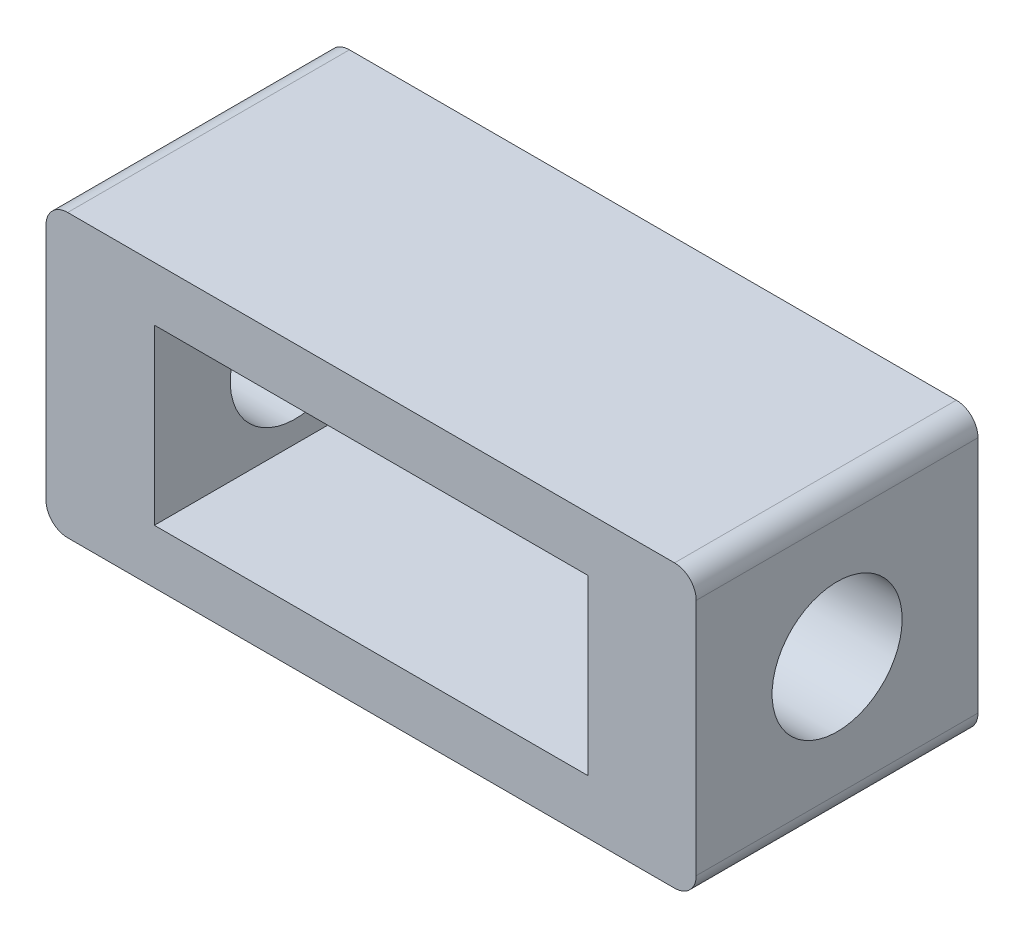
ISO-10303-21;
HEADER;
FILE_DESCRIPTION(('STEP AP214'),'2;1');
FILE_NAME('part.step','',(''),(''),'','','');
FILE_SCHEMA(('AUTOMOTIVE_DESIGN { 1 0 10303 214 1 1 1 1 }'));
ENDSEC;
DATA;
#1=APPLICATION_CONTEXT('core data for automotive mechanical design processes');
#2=APPLICATION_PROTOCOL_DEFINITION('international standard','automotive_design',2000,#1);
#3=PRODUCT_CONTEXT('',#1,'mechanical');
#4=PRODUCT('Part','Part','',(#3));
#5=PRODUCT_RELATED_PRODUCT_CATEGORY('part','',(#4));
#6=PRODUCT_DEFINITION_FORMATION('','',#4);
#7=PRODUCT_DEFINITION_CONTEXT('part definition',#1,'design');
#8=PRODUCT_DEFINITION('design','',#6,#7);
#9=PRODUCT_DEFINITION_SHAPE('','',#8);
#10=(LENGTH_UNIT() NAMED_UNIT(*) SI_UNIT(.MILLI.,.METRE.));
#11=(NAMED_UNIT(*) PLANE_ANGLE_UNIT() SI_UNIT($,.RADIAN.));
#12=(NAMED_UNIT(*) SI_UNIT($,.STERADIAN.) SOLID_ANGLE_UNIT());
#13=UNCERTAINTY_MEASURE_WITH_UNIT(LENGTH_MEASURE(1.E-05),#10,'distance_accuracy_value','');
#14=(GEOMETRIC_REPRESENTATION_CONTEXT(3) GLOBAL_UNCERTAINTY_ASSIGNED_CONTEXT((#13)) GLOBAL_UNIT_ASSIGNED_CONTEXT((#10,
#11,#12)) REPRESENTATION_CONTEXT('',''));
#15=CARTESIAN_POINT('',(0.,0.,0.));
#16=DIRECTION('',(0.,0.,1.));
#17=DIRECTION('',(1.,0.,0.));
#18=AXIS2_PLACEMENT_3D('',#15,#16,#17);
#19=CARTESIAN_POINT('',(2.,24.,26.));
#20=DIRECTION('',(0.,0.,-1.));
#21=DIRECTION('',(-1.,0.,0.));
#22=AXIS2_PLACEMENT_3D('',#19,#20,#21);
#23=PLANE('',#22);
#24=CARTESIAN_POINT('',(2.,24.,26.));
#25=DIRECTION('',(0.,0.,1.));
#26=DIRECTION('',(-1.,0.,0.));
#27=AXIS2_PLACEMENT_3D('',#24,#25,#26);
#28=CIRCLE('',#27,2.);
#29=CARTESIAN_POINT('',(2.00000000000001,26.,26.));
#30=VERTEX_POINT('',#29);
#31=CARTESIAN_POINT('',(0.,24.,26.));
#32=VERTEX_POINT('',#31);
#33=EDGE_CURVE('E160',#30,#32,#28,.T.);
#34=ORIENTED_EDGE('',*,*,#33,.T.);
#35=DIRECTION('',(0.,-1.,0.));
#36=VECTOR('',#35,1.);
#37=CARTESIAN_POINT('',(0.,2.00000000000001,26.));
#38=LINE('',#37,#36);
#39=CARTESIAN_POINT('',(0.,2.00000000000001,26.));
#40=VERTEX_POINT('',#39);
#41=EDGE_CURVE('E163',#32,#40,#38,.T.);
#42=ORIENTED_EDGE('',*,*,#41,.T.);
#43=CARTESIAN_POINT('',(2.,2.,26.));
#44=DIRECTION('',(0.,0.,1.));
#45=DIRECTION('',(-1.,0.,0.));
#46=AXIS2_PLACEMENT_3D('',#43,#44,#45);
#47=CIRCLE('',#46,2.);
#48=CARTESIAN_POINT('',(2.00000000000001,0.,26.));
#49=VERTEX_POINT('',#48);
#50=EDGE_CURVE('E166',#40,#49,#47,.T.);
#51=ORIENTED_EDGE('',*,*,#50,.T.);
#52=DIRECTION('',(1.,0.,0.));
#53=VECTOR('',#52,1.);
#54=CARTESIAN_POINT('',(2.00000000000001,0.,26.));
#55=LINE('',#54,#53);
#56=CARTESIAN_POINT('',(58.,0.,26.));
#57=VERTEX_POINT('',#56);
#58=EDGE_CURVE('E168',#49,#57,#55,.T.);
#59=ORIENTED_EDGE('',*,*,#58,.T.);
#60=CARTESIAN_POINT('',(58.,2.,26.));
#61=DIRECTION('',(0.,0.,1.));
#62=DIRECTION('',(1.,0.,0.));
#63=AXIS2_PLACEMENT_3D('',#60,#61,#62);
#64=CIRCLE('',#63,2.);
#65=CARTESIAN_POINT('',(60.,2.,26.));
#66=VERTEX_POINT('',#65);
#67=EDGE_CURVE('E170',#57,#66,#64,.T.);
#68=ORIENTED_EDGE('',*,*,#67,.T.);
#69=DIRECTION('',(0.,1.,0.));
#70=VECTOR('',#69,1.);
#71=CARTESIAN_POINT('',(60.,2.,26.));
#72=LINE('',#71,#70);
#73=CARTESIAN_POINT('',(60.,24.,26.));
#74=VERTEX_POINT('',#73);
#75=EDGE_CURVE('E172',#66,#74,#72,.T.);
#76=ORIENTED_EDGE('',*,*,#75,.T.);
#77=CARTESIAN_POINT('',(58.,24.,26.));
#78=DIRECTION('',(0.,0.,1.));
#79=DIRECTION('',(-1.,0.,0.));
#80=AXIS2_PLACEMENT_3D('',#77,#78,#79);
#81=CIRCLE('',#80,2.);
#82=CARTESIAN_POINT('',(58.,26.,26.));
#83=VERTEX_POINT('',#82);
#84=EDGE_CURVE('E174',#74,#83,#81,.T.);
#85=ORIENTED_EDGE('',*,*,#84,.T.);
#86=DIRECTION('',(-1.,0.,0.));
#87=VECTOR('',#86,1.);
#88=CARTESIAN_POINT('',(2.00000000000001,26.,26.));
#89=LINE('',#88,#87);
#90=EDGE_CURVE('E176',#83,#30,#89,.T.);
#91=ORIENTED_EDGE('',*,*,#90,.T.);
#92=EDGE_LOOP('',(#34,#42,#51,#59,#68,#76,#85,#91));
#93=FACE_BOUND('',#92,.T.);
#94=DIRECTION('',(0.,-1.,0.));
#95=VECTOR('',#94,1.);
#96=CARTESIAN_POINT('',(10.,21.,26.));
#97=LINE('',#96,#95);
#98=CARTESIAN_POINT('',(10.,21.,26.));
#99=VERTEX_POINT('',#98);
#100=CARTESIAN_POINT('',(10.,5.,26.));
#101=VERTEX_POINT('',#100);
#102=EDGE_CURVE('E122',#99,#101,#97,.T.);
#103=ORIENTED_EDGE('',*,*,#102,.F.);
#104=DIRECTION('',(-1.,0.,0.));
#105=VECTOR('',#104,1.);
#106=CARTESIAN_POINT('',(10.,21.,26.));
#107=LINE('',#106,#105);
#108=CARTESIAN_POINT('',(50.,21.,26.));
#109=VERTEX_POINT('',#108);
#110=EDGE_CURVE('E144',#109,#99,#107,.T.);
#111=ORIENTED_EDGE('',*,*,#110,.F.);
#112=DIRECTION('',(0.,1.,0.));
#113=VECTOR('',#112,1.);
#114=CARTESIAN_POINT('',(50.,21.,26.));
#115=LINE('',#114,#113);
#116=CARTESIAN_POINT('',(50.,5.,26.));
#117=VERTEX_POINT('',#116);
#118=EDGE_CURVE('E142',#117,#109,#115,.T.);
#119=ORIENTED_EDGE('',*,*,#118,.F.);
#120=DIRECTION('',(1.,0.,0.));
#121=VECTOR('',#120,1.);
#122=CARTESIAN_POINT('',(10.,5.,26.));
#123=LINE('',#122,#121);
#124=EDGE_CURVE('E130',#101,#117,#123,.T.);
#125=ORIENTED_EDGE('',*,*,#124,.F.);
#126=EDGE_LOOP('',(#103,#111,#119,#125));
#127=FACE_BOUND('',#126,.T.);
#128=ADVANCED_FACE('F32',(#93,#127),#23,.F.);
#129=CARTESIAN_POINT('',(2.,24.,0.));
#130=DIRECTION('',(0.,0.,-1.));
#131=DIRECTION('',(-1.,0.,0.));
#132=AXIS2_PLACEMENT_3D('',#129,#130,#131);
#133=PLANE('',#132);
#134=CARTESIAN_POINT('',(2.,24.,0.));
#135=DIRECTION('',(0.,0.,1.));
#136=DIRECTION('',(-1.,0.,0.));
#137=AXIS2_PLACEMENT_3D('',#134,#135,#136);
#138=CIRCLE('',#137,2.);
#139=CARTESIAN_POINT('',(2.00000000000001,26.,0.));
#140=VERTEX_POINT('',#139);
#141=CARTESIAN_POINT('',(0.,24.,0.));
#142=VERTEX_POINT('',#141);
#143=EDGE_CURVE('E138',#140,#142,#138,.T.);
#144=ORIENTED_EDGE('',*,*,#143,.F.);
#145=DIRECTION('',(-1.,0.,0.));
#146=VECTOR('',#145,1.);
#147=CARTESIAN_POINT('',(2.00000000000001,26.,0.));
#148=LINE('',#147,#146);
#149=CARTESIAN_POINT('',(58.,26.,0.));
#150=VERTEX_POINT('',#149);
#151=EDGE_CURVE('E164',#150,#140,#148,.T.);
#152=ORIENTED_EDGE('',*,*,#151,.F.);
#153=CARTESIAN_POINT('',(58.,24.,0.));
#154=DIRECTION('',(0.,0.,1.));
#155=DIRECTION('',(-1.,0.,0.));
#156=AXIS2_PLACEMENT_3D('',#153,#154,#155);
#157=CIRCLE('',#156,2.);
#158=CARTESIAN_POINT('',(60.,24.,0.));
#159=VERTEX_POINT('',#158);
#160=EDGE_CURVE('E191',#159,#150,#157,.T.);
#161=ORIENTED_EDGE('',*,*,#160,.F.);
#162=DIRECTION('',(0.,1.,0.));
#163=VECTOR('',#162,1.);
#164=CARTESIAN_POINT('',(60.,2.,0.));
#165=LINE('',#164,#163);
#166=CARTESIAN_POINT('',(60.,2.,0.));
#167=VERTEX_POINT('',#166);
#168=EDGE_CURVE('E189',#167,#159,#165,.T.);
#169=ORIENTED_EDGE('',*,*,#168,.F.);
#170=CARTESIAN_POINT('',(58.,2.,0.));
#171=DIRECTION('',(0.,0.,1.));
#172=DIRECTION('',(1.,0.,0.));
#173=AXIS2_PLACEMENT_3D('',#170,#171,#172);
#174=CIRCLE('',#173,2.);
#175=CARTESIAN_POINT('',(58.,0.,0.));
#176=VERTEX_POINT('',#175);
#177=EDGE_CURVE('E187',#176,#167,#174,.T.);
#178=ORIENTED_EDGE('',*,*,#177,.F.);
#179=DIRECTION('',(1.,0.,0.));
#180=VECTOR('',#179,1.);
#181=CARTESIAN_POINT('',(2.00000000000001,0.,0.));
#182=LINE('',#181,#180);
#183=CARTESIAN_POINT('',(2.00000000000001,0.,0.));
#184=VERTEX_POINT('',#183);
#185=EDGE_CURVE('E185',#184,#176,#182,.T.);
#186=ORIENTED_EDGE('',*,*,#185,.F.);
#187=CARTESIAN_POINT('',(2.,2.,0.));
#188=DIRECTION('',(0.,0.,1.));
#189=DIRECTION('',(-1.,0.,0.));
#190=AXIS2_PLACEMENT_3D('',#187,#188,#189);
#191=CIRCLE('',#190,2.);
#192=CARTESIAN_POINT('',(0.,2.00000000000001,0.));
#193=VERTEX_POINT('',#192);
#194=EDGE_CURVE('E183',#193,#184,#191,.T.);
#195=ORIENTED_EDGE('',*,*,#194,.F.);
#196=DIRECTION('',(0.,-1.,0.));
#197=VECTOR('',#196,1.);
#198=CARTESIAN_POINT('',(0.,2.00000000000001,0.));
#199=LINE('',#198,#197);
#200=EDGE_CURVE('E181',#142,#193,#199,.T.);
#201=ORIENTED_EDGE('',*,*,#200,.F.);
#202=EDGE_LOOP('',(#144,#152,#161,#169,#178,#186,#195,#201));
#203=FACE_BOUND('',#202,.T.);
#204=DIRECTION('',(-1.,0.,0.));
#205=VECTOR('',#204,1.);
#206=CARTESIAN_POINT('',(10.,21.,0.));
#207=LINE('',#206,#205);
#208=CARTESIAN_POINT('',(50.,21.,0.));
#209=VERTEX_POINT('',#208);
#210=CARTESIAN_POINT('',(10.,21.,0.));
#211=VERTEX_POINT('',#210);
#212=EDGE_CURVE('E131',#209,#211,#207,.T.);
#213=ORIENTED_EDGE('',*,*,#212,.T.);
#214=DIRECTION('',(0.,-1.,0.));
#215=VECTOR('',#214,1.);
#216=CARTESIAN_POINT('',(10.,21.,0.));
#217=LINE('',#216,#215);
#218=CARTESIAN_POINT('',(10.,5.,0.));
#219=VERTEX_POINT('',#218);
#220=EDGE_CURVE('E56',#211,#219,#217,.T.);
#221=ORIENTED_EDGE('',*,*,#220,.T.);
#222=DIRECTION('',(1.,0.,0.));
#223=VECTOR('',#222,1.);
#224=CARTESIAN_POINT('',(10.,5.,0.));
#225=LINE('',#224,#223);
#226=CARTESIAN_POINT('',(50.,5.,0.));
#227=VERTEX_POINT('',#226);
#228=EDGE_CURVE('E137',#219,#227,#225,.T.);
#229=ORIENTED_EDGE('',*,*,#228,.T.);
#230=DIRECTION('',(0.,1.,0.));
#231=VECTOR('',#230,1.);
#232=CARTESIAN_POINT('',(50.,21.,0.));
#233=LINE('',#232,#231);
#234=EDGE_CURVE('E152',#227,#209,#233,.T.);
#235=ORIENTED_EDGE('',*,*,#234,.T.);
#236=EDGE_LOOP('',(#213,#221,#229,#235));
#237=FACE_BOUND('',#236,.T.);
#238=ADVANCED_FACE('F222',(#203,#237),#133,.T.);
#239=CARTESIAN_POINT('',(2.,24.,26.));
#240=DIRECTION('',(0.,0.,-1.));
#241=DIRECTION('',(-1.,0.,0.));
#242=AXIS2_PLACEMENT_3D('',#239,#240,#241);
#243=CYLINDRICAL_SURFACE('',#242,2.);
#244=ORIENTED_EDGE('',*,*,#143,.T.);
#245=DIRECTION('',(0.,0.,-1.));
#246=VECTOR('',#245,1.);
#247=CARTESIAN_POINT('',(0.,24.,26.));
#248=LINE('',#247,#246);
#249=EDGE_CURVE('E11',#32,#142,#248,.T.);
#250=ORIENTED_EDGE('',*,*,#249,.F.);
#251=ORIENTED_EDGE('',*,*,#33,.F.);
#252=DIRECTION('',(0.,0.,-1.));
#253=VECTOR('',#252,1.);
#254=CARTESIAN_POINT('',(2.00000000000001,26.,26.));
#255=LINE('',#254,#253);
#256=EDGE_CURVE('E178',#30,#140,#255,.T.);
#257=ORIENTED_EDGE('',*,*,#256,.T.);
#258=EDGE_LOOP('',(#244,#250,#251,#257));
#259=FACE_BOUND('',#258,.T.);
#260=ADVANCED_FACE('F34',(#259),#243,.T.);
#261=CARTESIAN_POINT('',(0.,2.00000000000001,26.));
#262=DIRECTION('',(1.,0.,0.));
#263=DIRECTION('',(0.,0.,-1.));
#264=AXIS2_PLACEMENT_3D('',#261,#262,#263);
#265=PLANE('',#264);
#266=CARTESIAN_POINT('',(0.,13.,13.));
#267=DIRECTION('',(1.,0.,0.));
#268=DIRECTION('',(0.,0.,-1.));
#269=AXIS2_PLACEMENT_3D('',#266,#267,#268);
#270=CIRCLE('',#269,6.);
#271=CARTESIAN_POINT('',(0.,13.,7.));
#272=VERTEX_POINT('',#271);
#273=EDGE_CURVE('E285',#272,#272,#270,.T.);
#274=ORIENTED_EDGE('',*,*,#273,.T.);
#275=EDGE_LOOP('',(#274));
#276=FACE_BOUND('',#275,.T.);
#277=ORIENTED_EDGE('',*,*,#200,.T.);
#278=DIRECTION('',(0.,0.,-1.));
#279=VECTOR('',#278,1.);
#280=CARTESIAN_POINT('',(0.,2.00000000000001,26.));
#281=LINE('',#280,#279);
#282=EDGE_CURVE('E41',#40,#193,#281,.T.);
#283=ORIENTED_EDGE('',*,*,#282,.F.);
#284=ORIENTED_EDGE('',*,*,#41,.F.);
#285=ORIENTED_EDGE('',*,*,#249,.T.);
#286=EDGE_LOOP('',(#277,#283,#284,#285));
#287=FACE_BOUND('',#286,.T.);
#288=ADVANCED_FACE('F239',(#276,#287),#265,.F.);
#289=CARTESIAN_POINT('',(2.,2.,26.));
#290=DIRECTION('',(0.,0.,-1.));
#291=DIRECTION('',(-1.,0.,0.));
#292=AXIS2_PLACEMENT_3D('',#289,#290,#291);
#293=CYLINDRICAL_SURFACE('',#292,2.);
#294=ORIENTED_EDGE('',*,*,#194,.T.);
#295=DIRECTION('',(0.,0.,-1.));
#296=VECTOR('',#295,1.);
#297=CARTESIAN_POINT('',(2.00000000000001,0.,26.));
#298=LINE('',#297,#296);
#299=EDGE_CURVE('E208',#49,#184,#298,.T.);
#300=ORIENTED_EDGE('',*,*,#299,.F.);
#301=ORIENTED_EDGE('',*,*,#50,.F.);
#302=ORIENTED_EDGE('',*,*,#282,.T.);
#303=EDGE_LOOP('',(#294,#300,#301,#302));
#304=FACE_BOUND('',#303,.T.);
#305=ADVANCED_FACE('F216',(#304),#293,.T.);
#306=CARTESIAN_POINT('',(2.00000000000001,0.,26.));
#307=DIRECTION('',(0.,1.,0.));
#308=DIRECTION('',(0.,0.,1.));
#309=AXIS2_PLACEMENT_3D('',#306,#307,#308);
#310=PLANE('',#309);
#311=ORIENTED_EDGE('',*,*,#185,.T.);
#312=DIRECTION('',(0.,0.,-1.));
#313=VECTOR('',#312,1.);
#314=CARTESIAN_POINT('',(58.,0.,26.));
#315=LINE('',#314,#313);
#316=EDGE_CURVE('E205',#57,#176,#315,.T.);
#317=ORIENTED_EDGE('',*,*,#316,.F.);
#318=ORIENTED_EDGE('',*,*,#58,.F.);
#319=ORIENTED_EDGE('',*,*,#299,.T.);
#320=EDGE_LOOP('',(#311,#317,#318,#319));
#321=FACE_BOUND('',#320,.T.);
#322=ADVANCED_FACE('F228',(#321),#310,.F.);
#323=CARTESIAN_POINT('',(58.,2.,26.));
#324=DIRECTION('',(0.,0.,-1.));
#325=DIRECTION('',(-1.,0.,0.));
#326=AXIS2_PLACEMENT_3D('',#323,#324,#325);
#327=CYLINDRICAL_SURFACE('',#326,2.);
#328=ORIENTED_EDGE('',*,*,#177,.T.);
#329=DIRECTION('',(0.,0.,-1.));
#330=VECTOR('',#329,1.);
#331=CARTESIAN_POINT('',(60.,2.,26.));
#332=LINE('',#331,#330);
#333=EDGE_CURVE('E202',#66,#167,#332,.T.);
#334=ORIENTED_EDGE('',*,*,#333,.F.);
#335=ORIENTED_EDGE('',*,*,#67,.F.);
#336=ORIENTED_EDGE('',*,*,#316,.T.);
#337=EDGE_LOOP('',(#328,#334,#335,#336));
#338=FACE_BOUND('',#337,.T.);
#339=ADVANCED_FACE('F232',(#338),#327,.T.);
#340=CARTESIAN_POINT('',(60.,2.,26.));
#341=DIRECTION('',(-1.,0.,0.));
#342=DIRECTION('',(0.,0.,1.));
#343=AXIS2_PLACEMENT_3D('',#340,#341,#342);
#344=PLANE('',#343);
#345=CARTESIAN_POINT('',(60.,13.,13.));
#346=DIRECTION('',(1.,0.,0.));
#347=DIRECTION('',(0.,0.,-1.));
#348=AXIS2_PLACEMENT_3D('',#345,#346,#347);
#349=CIRCLE('',#348,6.);
#350=CARTESIAN_POINT('',(60.,13.,7.));
#351=VERTEX_POINT('',#350);
#352=EDGE_CURVE('E287',#351,#351,#349,.T.);
#353=ORIENTED_EDGE('',*,*,#352,.F.);
#354=EDGE_LOOP('',(#353));
#355=FACE_BOUND('',#354,.T.);
#356=ORIENTED_EDGE('',*,*,#168,.T.);
#357=DIRECTION('',(0.,0.,-1.));
#358=VECTOR('',#357,1.);
#359=CARTESIAN_POINT('',(60.,24.,26.));
#360=LINE('',#359,#358);
#361=EDGE_CURVE('E199',#74,#159,#360,.T.);
#362=ORIENTED_EDGE('',*,*,#361,.F.);
#363=ORIENTED_EDGE('',*,*,#75,.F.);
#364=ORIENTED_EDGE('',*,*,#333,.T.);
#365=EDGE_LOOP('',(#356,#362,#363,#364));
#366=FACE_BOUND('',#365,.T.);
#367=ADVANCED_FACE('F252',(#355,#366),#344,.F.);
#368=CARTESIAN_POINT('',(58.,24.,26.));
#369=DIRECTION('',(0.,0.,-1.));
#370=DIRECTION('',(-1.,0.,0.));
#371=AXIS2_PLACEMENT_3D('',#368,#369,#370);
#372=CYLINDRICAL_SURFACE('',#371,2.);
#373=ORIENTED_EDGE('',*,*,#160,.T.);
#374=DIRECTION('',(0.,0.,-1.));
#375=VECTOR('',#374,1.);
#376=CARTESIAN_POINT('',(58.,26.,26.));
#377=LINE('',#376,#375);
#378=EDGE_CURVE('E196',#83,#150,#377,.T.);
#379=ORIENTED_EDGE('',*,*,#378,.F.);
#380=ORIENTED_EDGE('',*,*,#84,.F.);
#381=ORIENTED_EDGE('',*,*,#361,.T.);
#382=EDGE_LOOP('',(#373,#379,#380,#381));
#383=FACE_BOUND('',#382,.T.);
#384=ADVANCED_FACE('F250',(#383),#372,.T.);
#385=CARTESIAN_POINT('',(2.00000000000001,26.,26.));
#386=DIRECTION('',(0.,-1.,0.));
#387=DIRECTION('',(0.,0.,-1.));
#388=AXIS2_PLACEMENT_3D('',#385,#386,#387);
#389=PLANE('',#388);
#390=ORIENTED_EDGE('',*,*,#151,.T.);
#391=ORIENTED_EDGE('',*,*,#256,.F.);
#392=ORIENTED_EDGE('',*,*,#90,.F.);
#393=ORIENTED_EDGE('',*,*,#378,.T.);
#394=EDGE_LOOP('',(#390,#391,#392,#393));
#395=FACE_BOUND('',#394,.T.);
#396=ADVANCED_FACE('F245',(#395),#389,.F.);
#397=CARTESIAN_POINT('',(10.,21.,26.));
#398=DIRECTION('',(1.,0.,0.));
#399=DIRECTION('',(0.,0.,-1.));
#400=AXIS2_PLACEMENT_3D('',#397,#398,#399);
#401=PLANE('',#400);
#402=CARTESIAN_POINT('',(10.,13.,13.));
#403=DIRECTION('',(1.,0.,0.));
#404=DIRECTION('',(0.,0.,-1.));
#405=AXIS2_PLACEMENT_3D('',#402,#403,#404);
#406=CIRCLE('',#405,6.);
#407=CARTESIAN_POINT('',(10.,13.,7.));
#408=VERTEX_POINT('',#407);
#409=EDGE_CURVE('E150',#408,#408,#406,.T.);
#410=ORIENTED_EDGE('',*,*,#409,.F.);
#411=EDGE_LOOP('',(#410));
#412=FACE_BOUND('',#411,.T.);
#413=ORIENTED_EDGE('',*,*,#220,.F.);
#414=DIRECTION('',(0.,0.,-1.));
#415=VECTOR('',#414,1.);
#416=CARTESIAN_POINT('',(10.,21.,26.));
#417=LINE('',#416,#415);
#418=EDGE_CURVE('E126',#99,#211,#417,.T.);
#419=ORIENTED_EDGE('',*,*,#418,.F.);
#420=ORIENTED_EDGE('',*,*,#102,.T.);
#421=DIRECTION('',(0.,0.,-1.));
#422=VECTOR('',#421,1.);
#423=CARTESIAN_POINT('',(10.,5.,26.));
#424=LINE('',#423,#422);
#425=EDGE_CURVE('E125',#101,#219,#424,.T.);
#426=ORIENTED_EDGE('',*,*,#425,.T.);
#427=EDGE_LOOP('',(#413,#419,#420,#426));
#428=FACE_BOUND('',#427,.T.);
#429=ADVANCED_FACE('F124',(#412,#428),#401,.T.);
#430=CARTESIAN_POINT('',(10.,5.,26.));
#431=DIRECTION('',(0.,1.,0.));
#432=DIRECTION('',(0.,0.,1.));
#433=AXIS2_PLACEMENT_3D('',#430,#431,#432);
#434=PLANE('',#433);
#435=ORIENTED_EDGE('',*,*,#228,.F.);
#436=ORIENTED_EDGE('',*,*,#425,.F.);
#437=ORIENTED_EDGE('',*,*,#124,.T.);
#438=DIRECTION('',(0.,0.,-1.));
#439=VECTOR('',#438,1.);
#440=CARTESIAN_POINT('',(50.,5.,26.));
#441=LINE('',#440,#439);
#442=EDGE_CURVE('E139',#117,#227,#441,.T.);
#443=ORIENTED_EDGE('',*,*,#442,.T.);
#444=EDGE_LOOP('',(#435,#436,#437,#443));
#445=FACE_BOUND('',#444,.T.);
#446=ADVANCED_FACE('F134',(#445),#434,.T.);
#447=CARTESIAN_POINT('',(50.,21.,26.));
#448=DIRECTION('',(-1.,0.,0.));
#449=DIRECTION('',(0.,0.,1.));
#450=AXIS2_PLACEMENT_3D('',#447,#448,#449);
#451=PLANE('',#450);
#452=CARTESIAN_POINT('',(50.,13.,13.));
#453=DIRECTION('',(-1.,0.,0.));
#454=DIRECTION('',(0.,0.,1.));
#455=AXIS2_PLACEMENT_3D('',#452,#453,#454);
#456=CIRCLE('',#455,6.);
#457=CARTESIAN_POINT('',(50.,13.,19.));
#458=VERTEX_POINT('',#457);
#459=EDGE_CURVE('E36',#458,#458,#456,.T.);
#460=ORIENTED_EDGE('',*,*,#459,.F.);
#461=EDGE_LOOP('',(#460));
#462=FACE_BOUND('',#461,.T.);
#463=ORIENTED_EDGE('',*,*,#234,.F.);
#464=ORIENTED_EDGE('',*,*,#442,.F.);
#465=ORIENTED_EDGE('',*,*,#118,.T.);
#466=DIRECTION('',(0.,0.,-1.));
#467=VECTOR('',#466,1.);
#468=CARTESIAN_POINT('',(50.,21.,26.));
#469=LINE('',#468,#467);
#470=EDGE_CURVE('E48',#109,#209,#469,.T.);
#471=ORIENTED_EDGE('',*,*,#470,.T.);
#472=EDGE_LOOP('',(#463,#464,#465,#471));
#473=FACE_BOUND('',#472,.T.);
#474=ADVANCED_FACE('F280',(#462,#473),#451,.T.);
#475=CARTESIAN_POINT('',(10.,21.,26.));
#476=DIRECTION('',(0.,-1.,0.));
#477=DIRECTION('',(0.,0.,-1.));
#478=AXIS2_PLACEMENT_3D('',#475,#476,#477);
#479=PLANE('',#478);
#480=ORIENTED_EDGE('',*,*,#212,.F.);
#481=ORIENTED_EDGE('',*,*,#470,.F.);
#482=ORIENTED_EDGE('',*,*,#110,.T.);
#483=ORIENTED_EDGE('',*,*,#418,.T.);
#484=EDGE_LOOP('',(#480,#481,#482,#483));
#485=FACE_BOUND('',#484,.T.);
#486=ADVANCED_FACE('F301',(#485),#479,.T.);
#487=CARTESIAN_POINT('',(0.,13.,13.));
#488=DIRECTION('',(1.,0.,0.));
#489=DIRECTION('',(0.,0.,-1.));
#490=AXIS2_PLACEMENT_3D('',#487,#488,#489);
#491=CYLINDRICAL_SURFACE('',#490,6.);
#492=ORIENTED_EDGE('',*,*,#459,.T.);
#493=EDGE_LOOP('',(#492));
#494=FACE_BOUND('',#493,.T.);
#495=ORIENTED_EDGE('',*,*,#352,.T.);
#496=EDGE_LOOP('',(#495));
#497=FACE_BOUND('',#496,.T.);
#498=ADVANCED_FACE('F296',(#494,#497),#491,.F.);
#499=ORIENTED_EDGE('',*,*,#409,.T.);
#500=EDGE_LOOP('',(#499));
#501=FACE_BOUND('',#500,.T.);
#502=ORIENTED_EDGE('',*,*,#273,.F.);
#503=EDGE_LOOP('',(#502));
#504=FACE_BOUND('',#503,.T.);
#505=ADVANCED_FACE('F294',(#501,#504),#491,.F.);
#506=CLOSED_SHELL('',(#128,#238,#260,#288,#305,#322,#339,#367,#384,#396,#429,#446,#474,#486,
#498,#505));
#507=MANIFOLD_SOLID_BREP('B2',#506);
#508=ADVANCED_BREP_SHAPE_REPRESENTATION('',(#18,#507),#14);
#509=SHAPE_DEFINITION_REPRESENTATION(#9,#508);
ENDSEC;
END-ISO-10303-21;
